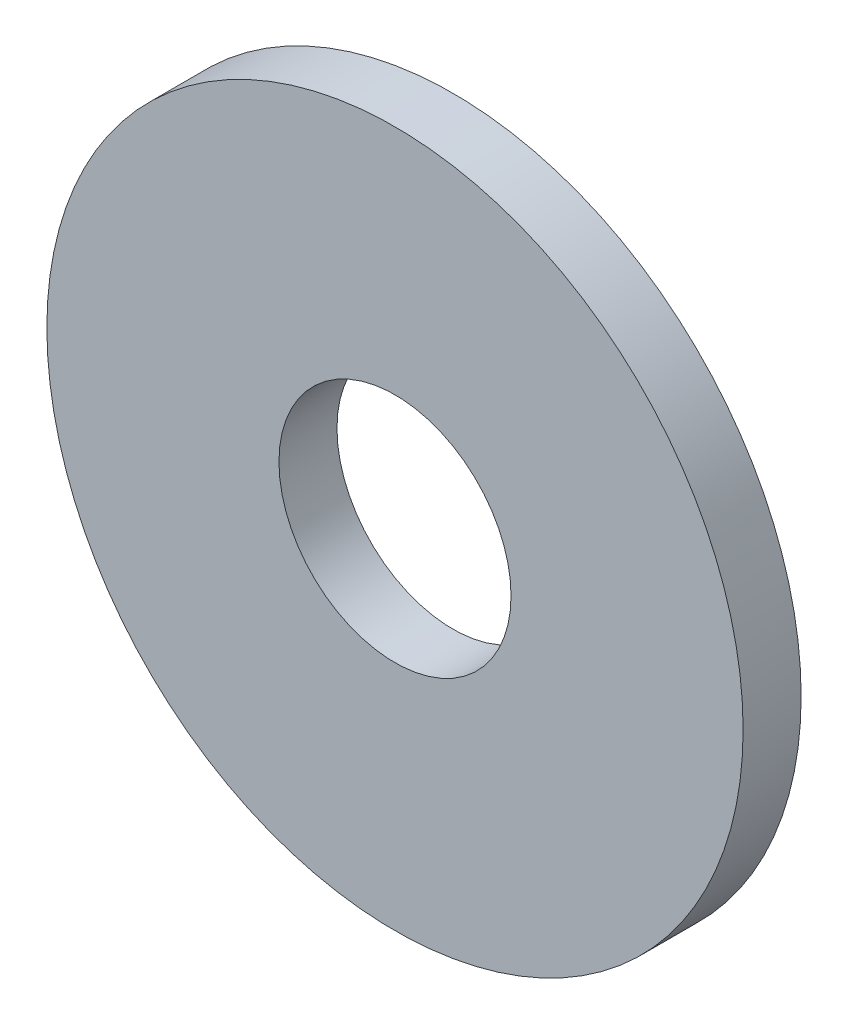
ISO-10303-21;
HEADER;
FILE_DESCRIPTION(('STEP AP214'),'2;1');
FILE_NAME('part.step','',(''),(''),'','','');
FILE_SCHEMA(('AUTOMOTIVE_DESIGN { 1 0 10303 214 1 1 1 1 }'));
ENDSEC;
DATA;
#1=APPLICATION_CONTEXT('core data for automotive mechanical design processes');
#2=APPLICATION_PROTOCOL_DEFINITION('international standard','automotive_design',2000,#1);
#3=PRODUCT_CONTEXT('',#1,'mechanical');
#4=PRODUCT('Part','Part','',(#3));
#5=PRODUCT_RELATED_PRODUCT_CATEGORY('part','',(#4));
#6=PRODUCT_DEFINITION_FORMATION('','',#4);
#7=PRODUCT_DEFINITION_CONTEXT('part definition',#1,'design');
#8=PRODUCT_DEFINITION('design','',#6,#7);
#9=PRODUCT_DEFINITION_SHAPE('','',#8);
#10=(LENGTH_UNIT() NAMED_UNIT(*) SI_UNIT(.MILLI.,.METRE.));
#11=(NAMED_UNIT(*) PLANE_ANGLE_UNIT() SI_UNIT($,.RADIAN.));
#12=(NAMED_UNIT(*) SI_UNIT($,.STERADIAN.) SOLID_ANGLE_UNIT());
#13=UNCERTAINTY_MEASURE_WITH_UNIT(LENGTH_MEASURE(1.E-05),#10,'distance_accuracy_value','');
#14=(GEOMETRIC_REPRESENTATION_CONTEXT(3) GLOBAL_UNCERTAINTY_ASSIGNED_CONTEXT((#13)) GLOBAL_UNIT_ASSIGNED_CONTEXT((#10,
#11,#12)) REPRESENTATION_CONTEXT('',''));
#15=CARTESIAN_POINT('',(0.,0.,0.));
#16=DIRECTION('',(0.,0.,1.));
#17=DIRECTION('',(1.,0.,0.));
#18=AXIS2_PLACEMENT_3D('',#15,#16,#17);
#19=CARTESIAN_POINT('',(0.,0.,1.5875));
#20=DIRECTION('',(0.,0.,1.));
#21=DIRECTION('',(1.,0.,0.));
#22=AXIS2_PLACEMENT_3D('',#19,#20,#21);
#23=PLANE('',#22);
#24=CARTESIAN_POINT('',(0.,0.,1.5875));
#25=DIRECTION('',(0.,0.,1.));
#26=DIRECTION('',(1.,0.,0.));
#27=AXIS2_PLACEMENT_3D('',#24,#25,#26);
#28=CIRCLE('',#27,9.525);
#29=CARTESIAN_POINT('',(9.525,0.,1.5875));
#30=VERTEX_POINT('',#29);
#31=EDGE_CURVE('E10',#30,#30,#28,.T.);
#32=ORIENTED_EDGE('',*,*,#31,.T.);
#33=EDGE_LOOP('',(#32));
#34=FACE_BOUND('',#33,.T.);
#35=CARTESIAN_POINT('',(0.,0.,1.5875));
#36=DIRECTION('',(0.,0.,1.));
#37=DIRECTION('',(1.,0.,0.));
#38=AXIS2_PLACEMENT_3D('',#35,#36,#37);
#39=CIRCLE('',#38,3.175);
#40=CARTESIAN_POINT('',(3.175,0.,1.5875));
#41=VERTEX_POINT('',#40);
#42=EDGE_CURVE('E42',#41,#41,#39,.T.);
#43=ORIENTED_EDGE('',*,*,#42,.F.);
#44=EDGE_LOOP('',(#43));
#45=FACE_BOUND('',#44,.T.);
#46=ADVANCED_FACE('F31',(#34,#45),#23,.T.);
#47=CARTESIAN_POINT('',(0.,0.,0.));
#48=DIRECTION('',(0.,0.,1.));
#49=DIRECTION('',(1.,0.,0.));
#50=AXIS2_PLACEMENT_3D('',#47,#48,#49);
#51=PLANE('',#50);
#52=CARTESIAN_POINT('',(0.,0.,0.));
#53=DIRECTION('',(0.,0.,1.));
#54=DIRECTION('',(1.,0.,0.));
#55=AXIS2_PLACEMENT_3D('',#52,#53,#54);
#56=CIRCLE('',#55,9.525);
#57=CARTESIAN_POINT('',(9.525,0.,0.));
#58=VERTEX_POINT('',#57);
#59=EDGE_CURVE('E35',#58,#58,#56,.T.);
#60=ORIENTED_EDGE('',*,*,#59,.F.);
#61=EDGE_LOOP('',(#60));
#62=FACE_BOUND('',#61,.T.);
#63=CARTESIAN_POINT('',(0.,0.,0.));
#64=DIRECTION('',(0.,0.,1.));
#65=DIRECTION('',(1.,0.,0.));
#66=AXIS2_PLACEMENT_3D('',#63,#64,#65);
#67=CIRCLE('',#66,3.175);
#68=CARTESIAN_POINT('',(3.175,0.,0.));
#69=VERTEX_POINT('',#68);
#70=EDGE_CURVE('E44',#69,#69,#67,.T.);
#71=ORIENTED_EDGE('',*,*,#70,.T.);
#72=EDGE_LOOP('',(#71));
#73=FACE_BOUND('',#72,.T.);
#74=ADVANCED_FACE('F54',(#62,#73),#51,.F.);
#75=CARTESIAN_POINT('',(0.,0.,1.5875));
#76=DIRECTION('',(0.,0.,-1.));
#77=DIRECTION('',(-1.,0.,0.));
#78=AXIS2_PLACEMENT_3D('',#75,#76,#77);
#79=CYLINDRICAL_SURFACE('',#78,9.525);
#80=ORIENTED_EDGE('',*,*,#31,.F.);
#81=EDGE_LOOP('',(#80));
#82=FACE_BOUND('',#81,.T.);
#83=ORIENTED_EDGE('',*,*,#59,.T.);
#84=EDGE_LOOP('',(#83));
#85=FACE_BOUND('',#84,.T.);
#86=ADVANCED_FACE('F33',(#82,#85),#79,.T.);
#87=CARTESIAN_POINT('',(0.,0.,1.5875));
#88=DIRECTION('',(0.,0.,-1.));
#89=DIRECTION('',(-1.,0.,0.));
#90=AXIS2_PLACEMENT_3D('',#87,#88,#89);
#91=CYLINDRICAL_SURFACE('',#90,3.175);
#92=ORIENTED_EDGE('',*,*,#42,.T.);
#93=EDGE_LOOP('',(#92));
#94=FACE_BOUND('',#93,.T.);
#95=ORIENTED_EDGE('',*,*,#70,.F.);
#96=EDGE_LOOP('',(#95));
#97=FACE_BOUND('',#96,.T.);
#98=ADVANCED_FACE('F50',(#94,#97),#91,.F.);
#99=CLOSED_SHELL('',(#46,#74,#86,#98));
#100=MANIFOLD_SOLID_BREP('B2',#99);
#101=ADVANCED_BREP_SHAPE_REPRESENTATION('',(#18,#100),#14);
#102=SHAPE_DEFINITION_REPRESENTATION(#9,#101);
ENDSEC;
END-ISO-10303-21;
